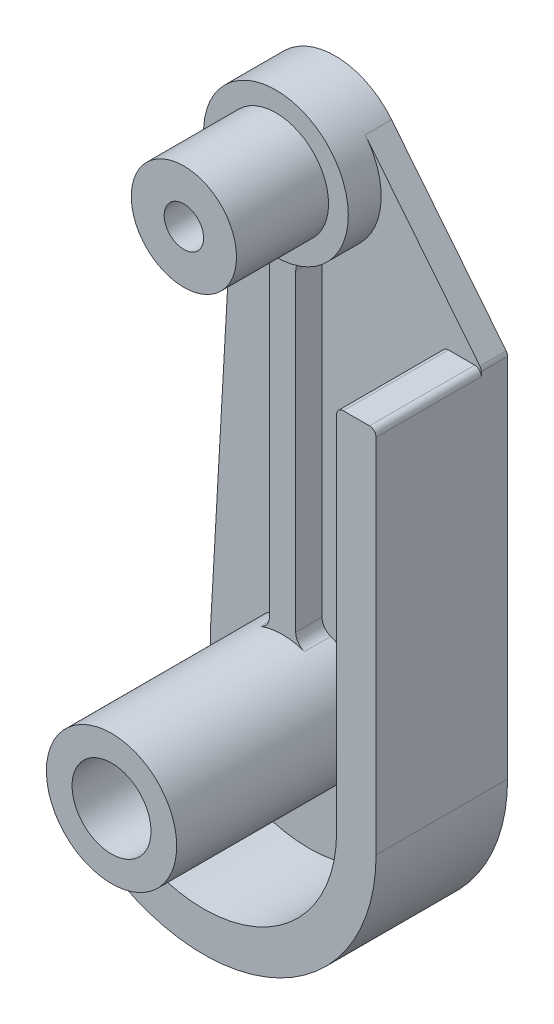
ISO-10303-21;
HEADER;
FILE_DESCRIPTION(('STEP AP214'),'2;1');
FILE_NAME('part.step','',(''),(''),'','','');
FILE_SCHEMA(('AUTOMOTIVE_DESIGN { 1 0 10303 214 1 1 1 1 }'));
ENDSEC;
DATA;
#1=APPLICATION_CONTEXT('core data for automotive mechanical design processes');
#2=APPLICATION_PROTOCOL_DEFINITION('international standard','automotive_design',2000,#1);
#3=PRODUCT_CONTEXT('',#1,'mechanical');
#4=PRODUCT('Part','Part','',(#3));
#5=PRODUCT_RELATED_PRODUCT_CATEGORY('part','',(#4));
#6=PRODUCT_DEFINITION_FORMATION('','',#4);
#7=PRODUCT_DEFINITION_CONTEXT('part definition',#1,'design');
#8=PRODUCT_DEFINITION('design','',#6,#7);
#9=PRODUCT_DEFINITION_SHAPE('','',#8);
#10=(LENGTH_UNIT() NAMED_UNIT(*) SI_UNIT(.MILLI.,.METRE.));
#11=(NAMED_UNIT(*) PLANE_ANGLE_UNIT() SI_UNIT($,.RADIAN.));
#12=(NAMED_UNIT(*) SI_UNIT($,.STERADIAN.) SOLID_ANGLE_UNIT());
#13=UNCERTAINTY_MEASURE_WITH_UNIT(LENGTH_MEASURE(1.E-05),#10,'distance_accuracy_value','');
#14=(GEOMETRIC_REPRESENTATION_CONTEXT(3) GLOBAL_UNCERTAINTY_ASSIGNED_CONTEXT((#13)) GLOBAL_UNIT_ASSIGNED_CONTEXT((#10,
#11,#12)) REPRESENTATION_CONTEXT('',''));
#15=CARTESIAN_POINT('',(0.,0.,0.));
#16=DIRECTION('',(0.,0.,1.));
#17=DIRECTION('',(1.,0.,0.));
#18=AXIS2_PLACEMENT_3D('',#15,#16,#17);
#19=CARTESIAN_POINT('',(0.,0.,2.));
#20=DIRECTION('',(0.,0.,1.));
#21=DIRECTION('',(1.,0.,0.));
#22=AXIS2_PLACEMENT_3D('',#19,#20,#21);
#23=PLANE('',#22);
#24=CARTESIAN_POINT('',(0.,35.56,2.));
#25=DIRECTION('',(0.,0.,1.));
#26=DIRECTION('',(1.,0.,0.));
#27=AXIS2_PLACEMENT_3D('',#24,#25,#26);
#28=CIRCLE('',#27,5.5);
#29=CARTESIAN_POINT('',(1.69230769230769,30.3268274751776,2.));
#30=VERTEX_POINT('',#29);
#31=CARTESIAN_POINT('',(4.29079082696684,39.00080137166,2.));
#32=VERTEX_POINT('',#31);
#33=EDGE_CURVE('E279',#30,#32,#28,.T.);
#34=ORIENTED_EDGE('',*,*,#33,.F.);
#35=CARTESIAN_POINT('',(2.,29.3753415615735,2.));
#36=DIRECTION('',(0.,0.,1.));
#37=DIRECTION('',(1.,0.,0.));
#38=AXIS2_PLACEMENT_3D('',#35,#36,#37);
#39=CIRCLE('',#38,1.);
#40=CARTESIAN_POINT('',(1.,29.3753415615735,2.));
#41=VERTEX_POINT('',#40);
#42=EDGE_CURVE('E493',#30,#41,#39,.T.);
#43=ORIENTED_EDGE('',*,*,#42,.T.);
#44=DIRECTION('',(0.,1.,0.));
#45=VECTOR('',#44,1.);
#46=CARTESIAN_POINT('',(1.,30.151673086804,2.));
#47=LINE('',#46,#45);
#48=CARTESIAN_POINT('',(0.999999999999998,5.60697859814,2.));
#49=VERTEX_POINT('',#48);
#50=EDGE_CURVE('E543',#49,#41,#47,.T.);
#51=ORIENTED_EDGE('',*,*,#50,.F.);
#52=CARTESIAN_POINT('',(2.,5.60697859814,2.));
#53=DIRECTION('',(0.,0.,1.));
#54=DIRECTION('',(1.,0.,0.));
#55=AXIS2_PLACEMENT_3D('',#52,#53,#54);
#56=CIRCLE('',#55,1.);
#57=CARTESIAN_POINT('',(1.6640349403662,4.66510414859523,2.));
#58=VERTEX_POINT('',#57);
#59=EDGE_CURVE('E488',#49,#58,#56,.T.);
#60=ORIENTED_EDGE('',*,*,#59,.T.);
#61=CARTESIAN_POINT('',(0.,0.,2.));
#62=DIRECTION('',(0.,0.,1.));
#63=DIRECTION('',(1.,0.,0.));
#64=AXIS2_PLACEMENT_3D('',#61,#62,#63);
#65=CIRCLE('',#64,4.953);
#66=CARTESIAN_POINT('',(-1.6640349403662,4.66510414859523,2.));
#67=VERTEX_POINT('',#66);
#68=EDGE_CURVE('E345',#58,#67,#65,.F.);
#69=ORIENTED_EDGE('',*,*,#68,.T.);
#70=CARTESIAN_POINT('',(-2.,5.60697859814,2.));
#71=DIRECTION('',(0.,0.,1.));
#72=DIRECTION('',(1.,0.,0.));
#73=AXIS2_PLACEMENT_3D('',#70,#71,#72);
#74=CIRCLE('',#73,1.);
#75=CARTESIAN_POINT('',(-0.999999999999998,5.60697859814,2.));
#76=VERTEX_POINT('',#75);
#77=EDGE_CURVE('E485',#67,#76,#74,.T.);
#78=ORIENTED_EDGE('',*,*,#77,.T.);
#79=DIRECTION('',(0.,-1.,0.));
#80=VECTOR('',#79,1.);
#81=CARTESIAN_POINT('',(-1.,30.151673086804,2.));
#82=LINE('',#81,#80);
#83=CARTESIAN_POINT('',(-1.,29.3753415615735,2.));
#84=VERTEX_POINT('',#83);
#85=EDGE_CURVE('E550',#84,#76,#82,.T.);
#86=ORIENTED_EDGE('',*,*,#85,.F.);
#87=CARTESIAN_POINT('',(-2.,29.3753415615735,2.));
#88=DIRECTION('',(0.,0.,1.));
#89=DIRECTION('',(1.,0.,0.));
#90=AXIS2_PLACEMENT_3D('',#87,#88,#89);
#91=CIRCLE('',#90,1.);
#92=CARTESIAN_POINT('',(-1.69230769230769,30.3268274751776,2.));
#93=VERTEX_POINT('',#92);
#94=EDGE_CURVE('E276',#84,#93,#91,.T.);
#95=ORIENTED_EDGE('',*,*,#94,.T.);
#96=CARTESIAN_POINT('',(-5.49129411278543,35.8693363329584,2.));
#97=VERTEX_POINT('',#96);
#98=EDGE_CURVE('E266',#97,#93,#28,.T.);
#99=ORIENTED_EDGE('',*,*,#98,.F.);
#100=DIRECTION('',(0.0562429696287964,0.998417111415532,0.));
#101=VECTOR('',#100,1.);
#102=CARTESIAN_POINT('',(-7.48812833561649,0.421822272215973,2.));
#103=LINE('',#102,#101);
#104=CARTESIAN_POINT('',(-7.48812833561649,0.421822272215973,2.));
#105=VERTEX_POINT('',#104);
#106=EDGE_CURVE('E247',#105,#97,#103,.T.);
#107=ORIENTED_EDGE('',*,*,#106,.F.);
#108=CARTESIAN_POINT('',(0.,0.,2.));
#109=DIRECTION('',(0.,0.,1.));
#110=DIRECTION('',(1.,0.,0.));
#111=AXIS2_PLACEMENT_3D('',#108,#109,#110);
#112=CIRCLE('',#111,7.5);
#113=CARTESIAN_POINT('',(-4.14861802271251,-6.24811719653409,2.));
#114=VERTEX_POINT('',#113);
#115=EDGE_CURVE('E259',#105,#114,#112,.T.);
#116=ORIENTED_EDGE('',*,*,#115,.T.);
#117=CARTESIAN_POINT('',(-4.42519255756001,-6.66465834296969,2.));
#118=DIRECTION('',(0.,0.,1.));
#119=DIRECTION('',(1.,0.,0.));
#120=AXIS2_PLACEMENT_3D('',#117,#118,#119);
#121=CIRCLE('',#120,0.5);
#122=CARTESIAN_POINT('',(-3.99217985566779,-6.91465834296969,2.));
#123=VERTEX_POINT('',#122);
#124=EDGE_CURVE('E475',#114,#123,#121,.F.);
#125=ORIENTED_EDGE('',*,*,#124,.T.);
#126=DIRECTION('',(0.499999999999995,0.866025403784442,0.));
#127=VECTOR('',#126,1.);
#128=CARTESIAN_POINT('',(0.,0.,2.));
#129=LINE('',#128,#127);
#130=CARTESIAN_POINT('',(-5.30029487718897,-9.18038002238847,2.));
#131=VERTEX_POINT('',#130);
#132=EDGE_CURVE('E356',#131,#123,#129,.T.);
#133=ORIENTED_EDGE('',*,*,#132,.F.);
#134=CARTESIAN_POINT('',(-4.86728217529675,-9.43038002238847,2.));
#135=DIRECTION('',(0.,0.,1.));
#136=DIRECTION('',(1.,0.,0.));
#137=AXIS2_PLACEMENT_3D('',#134,#135,#136);
#138=CIRCLE('',#137,0.5);
#139=CARTESIAN_POINT('',(-4.63796111496404,-8.98606948764066,2.));
#140=VERTEX_POINT('',#139);
#141=EDGE_CURVE('E469',#131,#140,#138,.F.);
#142=ORIENTED_EDGE('',*,*,#141,.T.);
#143=CARTESIAN_POINT('',(0.,0.,2.));
#144=DIRECTION('',(0.,0.,1.));
#145=DIRECTION('',(1.,0.,0.));
#146=AXIS2_PLACEMENT_3D('',#143,#144,#145);
#147=CIRCLE('',#146,10.112375);
#148=CARTESIAN_POINT('',(10.112375,0.,2.));
#149=VERTEX_POINT('',#148);
#150=EDGE_CURVE('E318',#149,#140,#147,.F.);
#151=ORIENTED_EDGE('',*,*,#150,.F.);
#152=DIRECTION('',(0.,-1.,0.));
#153=VECTOR('',#152,1.);
#154=CARTESIAN_POINT('',(10.112375,0.,2.));
#155=LINE('',#154,#153);
#156=CARTESIAN_POINT('',(10.112375,27.5,2.));
#157=VERTEX_POINT('',#156);
#158=EDGE_CURVE('E334',#157,#149,#155,.T.);
#159=ORIENTED_EDGE('',*,*,#158,.F.);
#160=CARTESIAN_POINT('',(10.612375,27.5,2.));
#161=DIRECTION('',(0.,0.,1.));
#162=DIRECTION('',(1.,0.,0.));
#163=AXIS2_PLACEMENT_3D('',#160,#161,#162);
#164=CIRCLE('',#163,0.5);
#165=CARTESIAN_POINT('',(10.612375,28.,2.));
#166=VERTEX_POINT('',#165);
#167=EDGE_CURVE('E419',#157,#166,#164,.F.);
#168=ORIENTED_EDGE('',*,*,#167,.T.);
#169=DIRECTION('',(-1.,0.,0.));
#170=VECTOR('',#169,1.);
#171=CARTESIAN_POINT('',(0.,28.,2.));
#172=LINE('',#171,#170);
#173=CARTESIAN_POINT('',(12.612375,28.,2.));
#174=VERTEX_POINT('',#173);
#175=EDGE_CURVE('E330',#174,#166,#172,.T.);
#176=ORIENTED_EDGE('',*,*,#175,.F.);
#177=CARTESIAN_POINT('',(12.612375,27.5,2.));
#178=DIRECTION('',(0.,0.,1.));
#179=DIRECTION('',(1.,0.,0.));
#180=AXIS2_PLACEMENT_3D('',#177,#178,#179);
#181=CIRCLE('',#180,0.5);
#182=CARTESIAN_POINT('',(13.112375,27.5,2.));
#183=VERTEX_POINT('',#182);
#184=EDGE_CURVE('E422',#174,#183,#181,.F.);
#185=ORIENTED_EDGE('',*,*,#184,.T.);
#186=DIRECTION('',(0.,-1.,0.));
#187=VECTOR('',#186,1.);
#188=CARTESIAN_POINT('',(13.112375,0.,2.));
#189=LINE('',#188,#187);
#190=CARTESIAN_POINT('',(13.112375,27.8242837870572,2.));
#191=VERTEX_POINT('',#190);
#192=EDGE_CURVE('E416',#191,#183,#189,.T.);
#193=ORIENTED_EDGE('',*,*,#192,.F.);
#194=CARTESIAN_POINT('',(12.612375,27.8242837870572,2.));
#195=DIRECTION('',(0.,0.,1.));
#196=DIRECTION('',(1.,0.,0.));
#197=AXIS2_PLACEMENT_3D('',#194,#195,#196);
#198=CIRCLE('',#197,0.5);
#199=CARTESIAN_POINT('',(13.0024468933606,28.1370839117535,2.));
#200=VERTEX_POINT('',#199);
#201=EDGE_CURVE('E436',#191,#200,#198,.T.);
#202=ORIENTED_EDGE('',*,*,#201,.T.);
#203=DIRECTION('',(0.625600249392723,-0.780143786721245,0.));
#204=VECTOR('',#203,1.);
#205=CARTESIAN_POINT('',(21.6461385533112,17.3581202694108,2.));
#206=LINE('',#205,#204);
#207=EDGE_CURVE('E260',#32,#200,#206,.T.);
#208=ORIENTED_EDGE('',*,*,#207,.F.);
#209=EDGE_LOOP('',(#34,#43,#51,#60,#69,#78,#86,#95,#99,#107,#116,#125,#133,#142,#151,#159,#168,
#176,#185,#193,#202,#208));
#210=FACE_BOUND('',#209,.T.);
#211=ADVANCED_FACE('F83',(#210),#23,.T.);
#212=CARTESIAN_POINT('',(0.,35.56,2.));
#213=DIRECTION('',(0.,0.,-1.));
#214=DIRECTION('',(-1.,0.,0.));
#215=AXIS2_PLACEMENT_3D('',#212,#213,#214);
#216=CYLINDRICAL_SURFACE('',#215,5.5);
#217=CARTESIAN_POINT('',(0.,35.56,4.5));
#218=DIRECTION('',(0.,0.,1.));
#219=DIRECTION('',(1.,0.,0.));
#220=AXIS2_PLACEMENT_3D('',#217,#218,#219);
#221=CIRCLE('',#220,5.5);
#222=CARTESIAN_POINT('',(5.5,35.56,4.5));
#223=VERTEX_POINT('',#222);
#224=EDGE_CURVE('E278',#223,#223,#221,.T.);
#225=ORIENTED_EDGE('',*,*,#224,.F.);
#226=EDGE_LOOP('',(#225));
#227=FACE_BOUND('',#226,.T.);
#228=CARTESIAN_POINT('',(0.,35.56,4.));
#229=DIRECTION('',(0.,0.,1.));
#230=DIRECTION('',(1.,0.,0.));
#231=AXIS2_PLACEMENT_3D('',#228,#229,#230);
#232=CIRCLE('',#231,5.5);
#233=CARTESIAN_POINT('',(-1.69230769230769,30.3268274751776,4.));
#234=VERTEX_POINT('',#233);
#235=CARTESIAN_POINT('',(1.69230769230769,30.3268274751776,4.));
#236=VERTEX_POINT('',#235);
#237=EDGE_CURVE('E538',#234,#236,#232,.T.);
#238=ORIENTED_EDGE('',*,*,#237,.T.);
#239=DIRECTION('',(0.,0.,-1.));
#240=VECTOR('',#239,1.);
#241=CARTESIAN_POINT('',(1.69230769230769,30.3268274751776,2.));
#242=LINE('',#241,#240);
#243=EDGE_CURVE('E481',#236,#30,#242,.T.);
#244=ORIENTED_EDGE('',*,*,#243,.T.);
#245=ORIENTED_EDGE('',*,*,#33,.T.);
#246=DIRECTION('',(0.,0.,-1.));
#247=VECTOR('',#246,1.);
#248=CARTESIAN_POINT('',(4.29079082696684,39.00080137166,2.));
#249=LINE('',#248,#247);
#250=CARTESIAN_POINT('',(4.29079082696684,39.00080137166,0.));
#251=VERTEX_POINT('',#250);
#252=EDGE_CURVE('E272',#32,#251,#249,.T.);
#253=ORIENTED_EDGE('',*,*,#252,.T.);
#254=CARTESIAN_POINT('',(0.,35.56,0.));
#255=DIRECTION('',(0.,0.,1.));
#256=DIRECTION('',(1.,0.,0.));
#257=AXIS2_PLACEMENT_3D('',#254,#255,#256);
#258=CIRCLE('',#257,5.5);
#259=CARTESIAN_POINT('',(-5.49129411278543,35.8693363329584,0.));
#260=VERTEX_POINT('',#259);
#261=EDGE_CURVE('E269',#251,#260,#258,.T.);
#262=ORIENTED_EDGE('',*,*,#261,.T.);
#263=DIRECTION('',(0.,0.,-1.));
#264=VECTOR('',#263,1.);
#265=CARTESIAN_POINT('',(-5.49129411278543,35.8693363329584,2.));
#266=LINE('',#265,#264);
#267=EDGE_CURVE('E251',#97,#260,#266,.T.);
#268=ORIENTED_EDGE('',*,*,#267,.F.);
#269=ORIENTED_EDGE('',*,*,#98,.T.);
#270=DIRECTION('',(0.,0.,-1.));
#271=VECTOR('',#270,1.);
#272=CARTESIAN_POINT('',(-1.69230769230769,30.3268274751776,2.));
#273=LINE('',#272,#271);
#274=EDGE_CURVE('E478',#93,#234,#273,.F.);
#275=ORIENTED_EDGE('',*,*,#274,.T.);
#276=EDGE_LOOP('',(#238,#244,#245,#253,#262,#268,#269,#275));
#277=FACE_BOUND('',#276,.T.);
#278=ADVANCED_FACE('F264',(#227,#277),#216,.T.);
#279=CARTESIAN_POINT('',(0.,0.,17.));
#280=DIRECTION('',(0.,0.,-1.));
#281=DIRECTION('',(-1.,0.,0.));
#282=AXIS2_PLACEMENT_3D('',#279,#280,#281);
#283=CYLINDRICAL_SURFACE('',#282,4.953);
#284=CARTESIAN_POINT('',(0.,0.,17.));
#285=DIRECTION('',(0.,0.,1.));
#286=DIRECTION('',(1.,0.,0.));
#287=AXIS2_PLACEMENT_3D('',#284,#285,#286);
#288=CIRCLE('',#287,4.953);
#289=CARTESIAN_POINT('',(4.953,0.,17.));
#290=VERTEX_POINT('',#289);
#291=EDGE_CURVE('E341',#290,#290,#288,.T.);
#292=ORIENTED_EDGE('',*,*,#291,.F.);
#293=EDGE_LOOP('',(#292));
#294=FACE_BOUND('',#293,.T.);
#295=ORIENTED_EDGE('',*,*,#68,.F.);
#296=DIRECTION('',(0.,0.,-1.));
#297=VECTOR('',#296,1.);
#298=CARTESIAN_POINT('',(1.6640349403662,4.66510414859523,17.));
#299=LINE('',#298,#297);
#300=CARTESIAN_POINT('',(1.6640349403662,4.66510414859523,4.));
#301=VERTEX_POINT('',#300);
#302=EDGE_CURVE('E513',#58,#301,#299,.F.);
#303=ORIENTED_EDGE('',*,*,#302,.T.);
#304=CARTESIAN_POINT('',(0.,0.,4.));
#305=DIRECTION('',(0.,0.,1.));
#306=DIRECTION('',(1.,0.,0.));
#307=AXIS2_PLACEMENT_3D('',#304,#305,#306);
#308=CIRCLE('',#307,4.953);
#309=CARTESIAN_POINT('',(-1.6640349403662,4.66510414859523,4.));
#310=VERTEX_POINT('',#309);
#311=EDGE_CURVE('E98',#301,#310,#308,.T.);
#312=ORIENTED_EDGE('',*,*,#311,.T.);
#313=DIRECTION('',(0.,0.,-1.));
#314=VECTOR('',#313,1.);
#315=CARTESIAN_POINT('',(-1.6640349403662,4.66510414859523,17.));
#316=LINE('',#315,#314);
#317=EDGE_CURVE('E510',#310,#67,#316,.T.);
#318=ORIENTED_EDGE('',*,*,#317,.T.);
#319=EDGE_LOOP('',(#295,#303,#312,#318));
#320=FACE_BOUND('',#319,.T.);
#321=ADVANCED_FACE('F544',(#294,#320),#283,.T.);
#322=CARTESIAN_POINT('',(0.,0.,2.));
#323=DIRECTION('',(0.,0.,-1.));
#324=DIRECTION('',(-1.,0.,0.));
#325=AXIS2_PLACEMENT_3D('',#322,#323,#324);
#326=CYLINDRICAL_SURFACE('',#325,13.112375);
#327=CARTESIAN_POINT('',(0.,0.,10.));
#328=DIRECTION('',(0.,0.,1.));
#329=DIRECTION('',(1.,0.,0.));
#330=AXIS2_PLACEMENT_3D('',#327,#328,#329);
#331=CIRCLE('',#330,13.112375);
#332=CARTESIAN_POINT('',(-6.10085468581522,-11.6066338894268,10.));
#333=VERTEX_POINT('',#332);
#334=CARTESIAN_POINT('',(13.112375,0.,10.));
#335=VERTEX_POINT('',#334);
#336=EDGE_CURVE('E322',#333,#335,#331,.T.);
#337=ORIENTED_EDGE('',*,*,#336,.F.);
#338=DIRECTION('',(0.,0.,-1.));
#339=VECTOR('',#338,1.);
#340=CARTESIAN_POINT('',(-6.10085468581522,-11.6066338894268,2.));
#341=LINE('',#340,#339);
#342=CARTESIAN_POINT('',(-6.10085468581522,-11.6066338894268,0.));
#343=VERTEX_POINT('',#342);
#344=EDGE_CURVE('E439',#333,#343,#341,.T.);
#345=ORIENTED_EDGE('',*,*,#344,.T.);
#346=CARTESIAN_POINT('',(0.,0.,0.));
#347=DIRECTION('',(0.,0.,1.));
#348=DIRECTION('',(1.,0.,0.));
#349=AXIS2_PLACEMENT_3D('',#346,#347,#348);
#350=CIRCLE('',#349,13.112375);
#351=CARTESIAN_POINT('',(13.112375,0.,0.));
#352=VERTEX_POINT('',#351);
#353=EDGE_CURVE('E349',#343,#352,#350,.T.);
#354=ORIENTED_EDGE('',*,*,#353,.T.);
#355=DIRECTION('',(0.,0.,-1.));
#356=VECTOR('',#355,1.);
#357=CARTESIAN_POINT('',(13.112375,0.,2.));
#358=LINE('',#357,#356);
#359=EDGE_CURVE('E390',#335,#352,#358,.T.);
#360=ORIENTED_EDGE('',*,*,#359,.F.);
#361=EDGE_LOOP('',(#337,#345,#354,#360));
#362=FACE_BOUND('',#361,.T.);
#363=ADVANCED_FACE('F621',(#362),#326,.T.);
#364=CARTESIAN_POINT('',(13.112375,0.,2.));
#365=DIRECTION('',(-1.,0.,0.));
#366=DIRECTION('',(0.,0.,1.));
#367=AXIS2_PLACEMENT_3D('',#364,#365,#366);
#368=PLANE('',#367);
#369=DIRECTION('',(0.,1.,0.));
#370=VECTOR('',#369,1.);
#371=CARTESIAN_POINT('',(13.112375,0.,0.));
#372=LINE('',#371,#370);
#373=CARTESIAN_POINT('',(13.112375,27.8242837870572,0.));
#374=VERTEX_POINT('',#373);
#375=EDGE_CURVE('E362',#352,#374,#372,.T.);
#376=ORIENTED_EDGE('',*,*,#375,.T.);
#377=DIRECTION('',(0.,0.,-1.));
#378=VECTOR('',#377,1.);
#379=CARTESIAN_POINT('',(13.112375,27.8242837870572,2.));
#380=LINE('',#379,#378);
#381=EDGE_CURVE('E433',#374,#191,#380,.F.);
#382=ORIENTED_EDGE('',*,*,#381,.T.);
#383=ORIENTED_EDGE('',*,*,#192,.T.);
#384=DIRECTION('',(0.,0.,-1.));
#385=VECTOR('',#384,1.);
#386=CARTESIAN_POINT('',(13.112375,27.5,10.));
#387=LINE('',#386,#385);
#388=CARTESIAN_POINT('',(13.112375,27.5,10.));
#389=VERTEX_POINT('',#388);
#390=EDGE_CURVE('E413',#183,#389,#387,.F.);
#391=ORIENTED_EDGE('',*,*,#390,.T.);
#392=DIRECTION('',(0.,1.,0.));
#393=VECTOR('',#392,1.);
#394=CARTESIAN_POINT('',(13.112375,0.,10.));
#395=LINE('',#394,#393);
#396=EDGE_CURVE('E310',#335,#389,#395,.T.);
#397=ORIENTED_EDGE('',*,*,#396,.F.);
#398=ORIENTED_EDGE('',*,*,#359,.T.);
#399=EDGE_LOOP('',(#376,#382,#383,#391,#397,#398));
#400=FACE_BOUND('',#399,.T.);
#401=ADVANCED_FACE('F617',(#400),#368,.F.);
#402=CARTESIAN_POINT('',(21.6461385533112,17.3581202694108,2.));
#403=DIRECTION('',(0.780143786721245,0.625600249392723,0.));
#404=DIRECTION('',(-0.625600249392723,0.780143786721245,0.));
#405=AXIS2_PLACEMENT_3D('',#402,#403,#404);
#406=PLANE('',#405);
#407=ORIENTED_EDGE('',*,*,#207,.T.);
#408=DIRECTION('',(0.,0.,-1.));
#409=VECTOR('',#408,1.);
#410=CARTESIAN_POINT('',(13.0024468933606,28.1370839117535,0.));
#411=LINE('',#410,#409);
#412=CARTESIAN_POINT('',(13.0024468933606,28.1370839117535,0.));
#413=VERTEX_POINT('',#412);
#414=EDGE_CURVE('E426',#200,#413,#411,.T.);
#415=ORIENTED_EDGE('',*,*,#414,.T.);
#416=DIRECTION('',(0.625600249392723,-0.780143786721245,0.));
#417=VECTOR('',#416,1.);
#418=CARTESIAN_POINT('',(21.6461385533112,17.3581202694108,0.));
#419=LINE('',#418,#417);
#420=EDGE_CURVE('E366',#251,#413,#419,.T.);
#421=ORIENTED_EDGE('',*,*,#420,.F.);
#422=ORIENTED_EDGE('',*,*,#252,.F.);
#423=EDGE_LOOP('',(#407,#415,#421,#422));
#424=FACE_BOUND('',#423,.T.);
#425=ADVANCED_FACE('F613',(#424),#406,.T.);
#426=CARTESIAN_POINT('',(-7.48812833561649,0.421822272215973,2.));
#427=DIRECTION('',(-0.998417111415532,0.0562429696287964,0.));
#428=DIRECTION('',(-0.0562429696287964,-0.998417111415532,0.));
#429=AXIS2_PLACEMENT_3D('',#426,#427,#428);
#430=PLANE('',#429);
#431=DIRECTION('',(0.0562429696287964,0.998417111415532,0.));
#432=VECTOR('',#431,1.);
#433=CARTESIAN_POINT('',(-7.48812833561649,0.421822272215973,0.));
#434=LINE('',#433,#432);
#435=CARTESIAN_POINT('',(-7.48812833561649,0.421822272215973,0.));
#436=VERTEX_POINT('',#435);
#437=EDGE_CURVE('E372',#436,#260,#434,.T.);
#438=ORIENTED_EDGE('',*,*,#437,.F.);
#439=DIRECTION('',(0.,0.,-1.));
#440=VECTOR('',#439,1.);
#441=CARTESIAN_POINT('',(-7.48812833561649,0.421822272215973,2.));
#442=LINE('',#441,#440);
#443=EDGE_CURVE('E253',#105,#436,#442,.T.);
#444=ORIENTED_EDGE('',*,*,#443,.F.);
#445=ORIENTED_EDGE('',*,*,#106,.T.);
#446=ORIENTED_EDGE('',*,*,#267,.T.);
#447=EDGE_LOOP('',(#438,#444,#445,#446));
#448=FACE_BOUND('',#447,.T.);
#449=ADVANCED_FACE('F250',(#448),#430,.T.);
#450=CARTESIAN_POINT('',(0.,0.,2.));
#451=DIRECTION('',(0.,0.,-1.));
#452=DIRECTION('',(-1.,0.,0.));
#453=AXIS2_PLACEMENT_3D('',#450,#451,#452);
#454=CYLINDRICAL_SURFACE('',#453,7.5);
#455=CARTESIAN_POINT('',(0.,0.,0.));
#456=DIRECTION('',(0.,0.,1.));
#457=DIRECTION('',(1.,0.,0.));
#458=AXIS2_PLACEMENT_3D('',#455,#456,#457);
#459=CIRCLE('',#458,7.5);
#460=CARTESIAN_POINT('',(-4.14861802271251,-6.24811719653409,0.));
#461=VERTEX_POINT('',#460);
#462=EDGE_CURVE('E375',#436,#461,#459,.T.);
#463=ORIENTED_EDGE('',*,*,#462,.T.);
#464=DIRECTION('',(0.,0.,-1.));
#465=VECTOR('',#464,1.);
#466=CARTESIAN_POINT('',(-4.14861802271251,-6.24811719653409,2.));
#467=LINE('',#466,#465);
#468=EDGE_CURVE('E466',#461,#114,#467,.F.);
#469=ORIENTED_EDGE('',*,*,#468,.T.);
#470=ORIENTED_EDGE('',*,*,#115,.F.);
#471=ORIENTED_EDGE('',*,*,#443,.T.);
#472=EDGE_LOOP('',(#463,#469,#470,#471));
#473=FACE_BOUND('',#472,.T.);
#474=ADVANCED_FACE('F607',(#473),#454,.T.);
#475=CARTESIAN_POINT('',(0.,0.,2.));
#476=DIRECTION('',(-0.866025403784442,0.499999999999995,0.));
#477=DIRECTION('',(-0.499999999999995,-0.866025403784442,0.));
#478=AXIS2_PLACEMENT_3D('',#475,#476,#477);
#479=PLANE('',#478);
#480=DIRECTION('',(0.499999999999995,0.866025403784442,0.));
#481=VECTOR('',#480,1.);
#482=CARTESIAN_POINT('',(0.,0.,0.));
#483=LINE('',#482,#481);
#484=CARTESIAN_POINT('',(-6.30123010095294,-10.914050685033,0.));
#485=VERTEX_POINT('',#484);
#486=CARTESIAN_POINT('',(-3.99217985566779,-6.91465834296969,0.));
#487=VERTEX_POINT('',#486);
#488=EDGE_CURVE('E379',#485,#487,#483,.T.);
#489=ORIENTED_EDGE('',*,*,#488,.F.);
#490=DIRECTION('',(0.,0.,1.));
#491=VECTOR('',#490,1.);
#492=CARTESIAN_POINT('',(-6.30123010095294,-10.914050685033,10.));
#493=LINE('',#492,#491);
#494=CARTESIAN_POINT('',(-6.30123010095294,-10.914050685033,10.));
#495=VERTEX_POINT('',#494);
#496=EDGE_CURVE('E454',#485,#495,#493,.T.);
#497=ORIENTED_EDGE('',*,*,#496,.T.);
#498=DIRECTION('',(-0.499999999999995,-0.866025403784442,0.));
#499=VECTOR('',#498,1.);
#500=CARTESIAN_POINT('',(-5.05618749999994,-8.75757364259469,10.));
#501=LINE('',#500,#499);
#502=CARTESIAN_POINT('',(-5.30029487718897,-9.18038002238847,10.));
#503=VERTEX_POINT('',#502);
#504=EDGE_CURVE('E297',#503,#495,#501,.T.);
#505=ORIENTED_EDGE('',*,*,#504,.F.);
#506=DIRECTION('',(0.,0.,-1.));
#507=VECTOR('',#506,1.);
#508=CARTESIAN_POINT('',(-5.30029487718897,-9.18038002238847,2.));
#509=LINE('',#508,#507);
#510=EDGE_CURVE('E450',#503,#131,#509,.T.);
#511=ORIENTED_EDGE('',*,*,#510,.T.);
#512=ORIENTED_EDGE('',*,*,#132,.T.);
#513=DIRECTION('',(0.,0.,-1.));
#514=VECTOR('',#513,1.);
#515=CARTESIAN_POINT('',(-3.99217985566778,-6.91465834296969,2.));
#516=LINE('',#515,#514);
#517=EDGE_CURVE('E446',#123,#487,#516,.T.);
#518=ORIENTED_EDGE('',*,*,#517,.T.);
#519=EDGE_LOOP('',(#489,#497,#505,#511,#512,#518));
#520=FACE_BOUND('',#519,.T.);
#521=ADVANCED_FACE('F603',(#520),#479,.T.);
#522=CARTESIAN_POINT('',(0.,0.,2.));
#523=DIRECTION('',(0.,0.,-1.));
#524=DIRECTION('',(-1.,0.,0.));
#525=AXIS2_PLACEMENT_3D('',#522,#523,#524);
#526=CYLINDRICAL_SURFACE('',#525,3.);
#527=CARTESIAN_POINT('',(0.,0.,0.));
#528=DIRECTION('',(0.,0.,1.));
#529=DIRECTION('',(1.,0.,0.));
#530=AXIS2_PLACEMENT_3D('',#527,#528,#529);
#531=CIRCLE('',#530,3.);
#532=CARTESIAN_POINT('',(3.,0.,0.));
#533=VERTEX_POINT('',#532);
#534=EDGE_CURVE('E352',#533,#533,#531,.T.);
#535=ORIENTED_EDGE('',*,*,#534,.F.);
#536=EDGE_LOOP('',(#535));
#537=FACE_BOUND('',#536,.T.);
#538=CARTESIAN_POINT('',(0.,0.,17.));
#539=DIRECTION('',(0.,0.,1.));
#540=DIRECTION('',(1.,0.,0.));
#541=AXIS2_PLACEMENT_3D('',#538,#539,#540);
#542=CIRCLE('',#541,3.);
#543=CARTESIAN_POINT('',(3.,0.,17.));
#544=VERTEX_POINT('',#543);
#545=EDGE_CURVE('E337',#544,#544,#542,.T.);
#546=ORIENTED_EDGE('',*,*,#545,.T.);
#547=EDGE_LOOP('',(#546));
#548=FACE_BOUND('',#547,.T.);
#549=ADVANCED_FACE('F599',(#537,#548),#526,.F.);
#550=CARTESIAN_POINT('',(0.,0.,0.));
#551=DIRECTION('',(0.,0.,1.));
#552=DIRECTION('',(1.,0.,0.));
#553=AXIS2_PLACEMENT_3D('',#550,#551,#552);
#554=PLANE('',#553);
#555=ORIENTED_EDGE('',*,*,#353,.F.);
#556=CARTESIAN_POINT('',(-5.86821739906072,-11.164050685033,0.));
#557=DIRECTION('',(0.,0.,1.));
#558=DIRECTION('',(1.,0.,0.));
#559=AXIS2_PLACEMENT_3D('',#556,#557,#558);
#560=CIRCLE('',#559,0.5);
#561=EDGE_CURVE('E443',#343,#485,#560,.F.);
#562=ORIENTED_EDGE('',*,*,#561,.T.);
#563=ORIENTED_EDGE('',*,*,#488,.T.);
#564=CARTESIAN_POINT('',(-4.42519255756001,-6.66465834296969,0.));
#565=DIRECTION('',(0.,0.,1.));
#566=DIRECTION('',(1.,0.,0.));
#567=AXIS2_PLACEMENT_3D('',#564,#565,#566);
#568=CIRCLE('',#567,0.5);
#569=EDGE_CURVE('E472',#487,#461,#568,.T.);
#570=ORIENTED_EDGE('',*,*,#569,.T.);
#571=ORIENTED_EDGE('',*,*,#462,.F.);
#572=ORIENTED_EDGE('',*,*,#437,.T.);
#573=ORIENTED_EDGE('',*,*,#261,.F.);
#574=ORIENTED_EDGE('',*,*,#420,.T.);
#575=CARTESIAN_POINT('',(12.612375,27.8242837870572,0.));
#576=DIRECTION('',(0.,0.,1.));
#577=DIRECTION('',(1.,0.,0.));
#578=AXIS2_PLACEMENT_3D('',#575,#576,#577);
#579=CIRCLE('',#578,0.5);
#580=EDGE_CURVE('E430',#413,#374,#579,.F.);
#581=ORIENTED_EDGE('',*,*,#580,.T.);
#582=ORIENTED_EDGE('',*,*,#375,.F.);
#583=EDGE_LOOP('',(#555,#562,#563,#570,#571,#572,#573,#574,#581,#582));
#584=FACE_BOUND('',#583,.T.);
#585=ORIENTED_EDGE('',*,*,#534,.T.);
#586=EDGE_LOOP('',(#585));
#587=FACE_BOUND('',#586,.T.);
#588=CARTESIAN_POINT('',(0.,35.56,0.));
#589=DIRECTION('',(0.,0.,1.));
#590=DIRECTION('',(1.,0.,0.));
#591=AXIS2_PLACEMENT_3D('',#588,#589,#590);
#592=CIRCLE('',#591,1.5);
#593=CARTESIAN_POINT('',(1.5,35.56,0.));
#594=VERTEX_POINT('',#593);
#595=EDGE_CURVE('E284',#594,#594,#592,.T.);
#596=ORIENTED_EDGE('',*,*,#595,.T.);
#597=EDGE_LOOP('',(#596));
#598=FACE_BOUND('',#597,.T.);
#599=ADVANCED_FACE('F595',(#584,#587,#598),#554,.F.);
#600=CARTESIAN_POINT('',(0.,0.,17.));
#601=DIRECTION('',(0.,0.,1.));
#602=DIRECTION('',(1.,0.,0.));
#603=AXIS2_PLACEMENT_3D('',#600,#601,#602);
#604=PLANE('',#603);
#605=ORIENTED_EDGE('',*,*,#545,.F.);
#606=EDGE_LOOP('',(#605));
#607=FACE_BOUND('',#606,.T.);
#608=ORIENTED_EDGE('',*,*,#291,.T.);
#609=EDGE_LOOP('',(#608));
#610=FACE_BOUND('',#609,.T.);
#611=ADVANCED_FACE('F598',(#607,#610),#604,.T.);
#612=CARTESIAN_POINT('',(10.112375,0.,10.));
#613=DIRECTION('',(-1.,0.,0.));
#614=DIRECTION('',(0.,0.,1.));
#615=AXIS2_PLACEMENT_3D('',#612,#613,#614);
#616=PLANE('',#615);
#617=DIRECTION('',(0.,1.,0.));
#618=VECTOR('',#617,1.);
#619=CARTESIAN_POINT('',(10.112375,0.,10.));
#620=LINE('',#619,#618);
#621=CARTESIAN_POINT('',(10.112375,0.,10.));
#622=VERTEX_POINT('',#621);
#623=CARTESIAN_POINT('',(10.112375,27.5,10.));
#624=VERTEX_POINT('',#623);
#625=EDGE_CURVE('E305',#622,#624,#620,.T.);
#626=ORIENTED_EDGE('',*,*,#625,.T.);
#627=DIRECTION('',(0.,0.,-1.));
#628=VECTOR('',#627,1.);
#629=CARTESIAN_POINT('',(10.112375,27.5,10.));
#630=LINE('',#629,#628);
#631=EDGE_CURVE('E396',#624,#157,#630,.T.);
#632=ORIENTED_EDGE('',*,*,#631,.T.);
#633=ORIENTED_EDGE('',*,*,#158,.T.);
#634=DIRECTION('',(0.,0.,-1.));
#635=VECTOR('',#634,1.);
#636=CARTESIAN_POINT('',(10.112375,0.,10.));
#637=LINE('',#636,#635);
#638=EDGE_CURVE('E314',#622,#149,#637,.T.);
#639=ORIENTED_EDGE('',*,*,#638,.F.);
#640=EDGE_LOOP('',(#626,#632,#633,#639));
#641=FACE_BOUND('',#640,.T.);
#642=ADVANCED_FACE('F816',(#641),#616,.T.);
#643=CARTESIAN_POINT('',(0.,28.,10.));
#644=DIRECTION('',(0.,1.,0.));
#645=DIRECTION('',(0.,0.,1.));
#646=AXIS2_PLACEMENT_3D('',#643,#644,#645);
#647=PLANE('',#646);
#648=ORIENTED_EDGE('',*,*,#175,.T.);
#649=DIRECTION('',(0.,0.,-1.));
#650=VECTOR('',#649,1.);
#651=CARTESIAN_POINT('',(10.612375,28.,10.));
#652=LINE('',#651,#650);
#653=CARTESIAN_POINT('',(10.612375,28.,10.));
#654=VERTEX_POINT('',#653);
#655=EDGE_CURVE('E404',#166,#654,#652,.F.);
#656=ORIENTED_EDGE('',*,*,#655,.T.);
#657=DIRECTION('',(1.,0.,0.));
#658=VECTOR('',#657,1.);
#659=CARTESIAN_POINT('',(0.,28.,10.));
#660=LINE('',#659,#658);
#661=CARTESIAN_POINT('',(12.612375,28.,10.));
#662=VERTEX_POINT('',#661);
#663=EDGE_CURVE('E301',#654,#662,#660,.T.);
#664=ORIENTED_EDGE('',*,*,#663,.T.);
#665=DIRECTION('',(0.,0.,-1.));
#666=VECTOR('',#665,1.);
#667=CARTESIAN_POINT('',(12.612375,28.,2.));
#668=LINE('',#667,#666);
#669=EDGE_CURVE('E400',#662,#174,#668,.T.);
#670=ORIENTED_EDGE('',*,*,#669,.T.);
#671=EDGE_LOOP('',(#648,#656,#664,#670));
#672=FACE_BOUND('',#671,.T.);
#673=ADVANCED_FACE('F806',(#672),#647,.T.);
#674=CARTESIAN_POINT('',(0.,0.,10.));
#675=DIRECTION('',(0.,0.,1.));
#676=DIRECTION('',(1.,0.,0.));
#677=AXIS2_PLACEMENT_3D('',#674,#675,#676);
#678=PLANE('',#677);
#679=ORIENTED_EDGE('',*,*,#504,.T.);
#680=CARTESIAN_POINT('',(-5.86821739906072,-11.164050685033,10.));
#681=DIRECTION('',(0.,0.,1.));
#682=DIRECTION('',(1.,0.,0.));
#683=AXIS2_PLACEMENT_3D('',#680,#681,#682);
#684=CIRCLE('',#683,0.5);
#685=EDGE_CURVE('E460',#495,#333,#684,.T.);
#686=ORIENTED_EDGE('',*,*,#685,.T.);
#687=ORIENTED_EDGE('',*,*,#336,.T.);
#688=ORIENTED_EDGE('',*,*,#396,.T.);
#689=CARTESIAN_POINT('',(12.612375,27.5,10.));
#690=DIRECTION('',(0.,0.,1.));
#691=DIRECTION('',(1.,0.,0.));
#692=AXIS2_PLACEMENT_3D('',#689,#690,#691);
#693=CIRCLE('',#692,0.5);
#694=EDGE_CURVE('E407',#389,#662,#693,.T.);
#695=ORIENTED_EDGE('',*,*,#694,.T.);
#696=ORIENTED_EDGE('',*,*,#663,.F.);
#697=CARTESIAN_POINT('',(10.612375,27.5,10.));
#698=DIRECTION('',(0.,0.,1.));
#699=DIRECTION('',(1.,0.,0.));
#700=AXIS2_PLACEMENT_3D('',#697,#698,#699);
#701=CIRCLE('',#700,0.5);
#702=EDGE_CURVE('E410',#654,#624,#701,.T.);
#703=ORIENTED_EDGE('',*,*,#702,.T.);
#704=ORIENTED_EDGE('',*,*,#625,.F.);
#705=CARTESIAN_POINT('',(0.,0.,10.));
#706=DIRECTION('',(0.,0.,1.));
#707=DIRECTION('',(1.,0.,0.));
#708=AXIS2_PLACEMENT_3D('',#705,#706,#707);
#709=CIRCLE('',#708,10.112375);
#710=CARTESIAN_POINT('',(-4.63796111496404,-8.98606948764066,10.));
#711=VERTEX_POINT('',#710);
#712=EDGE_CURVE('E306',#711,#622,#709,.T.);
#713=ORIENTED_EDGE('',*,*,#712,.F.);
#714=CARTESIAN_POINT('',(-4.86728217529675,-9.43038002238847,10.));
#715=DIRECTION('',(0.,0.,1.));
#716=DIRECTION('',(1.,0.,0.));
#717=AXIS2_PLACEMENT_3D('',#714,#715,#716);
#718=CIRCLE('',#717,0.5);
#719=EDGE_CURVE('E457',#711,#503,#718,.T.);
#720=ORIENTED_EDGE('',*,*,#719,.T.);
#721=EDGE_LOOP('',(#679,#686,#687,#688,#695,#696,#703,#704,#713,#720));
#722=FACE_BOUND('',#721,.T.);
#723=ADVANCED_FACE('F796',(#722),#678,.T.);
#724=CARTESIAN_POINT('',(0.,0.,10.));
#725=DIRECTION('',(0.,0.,-1.));
#726=DIRECTION('',(-1.,0.,0.));
#727=AXIS2_PLACEMENT_3D('',#724,#725,#726);
#728=CYLINDRICAL_SURFACE('',#727,10.112375);
#729=ORIENTED_EDGE('',*,*,#150,.T.);
#730=DIRECTION('',(0.,0.,-1.));
#731=VECTOR('',#730,1.);
#732=CARTESIAN_POINT('',(-4.63796111496404,-8.98606948764067,10.));
#733=LINE('',#732,#731);
#734=EDGE_CURVE('E463',#140,#711,#733,.F.);
#735=ORIENTED_EDGE('',*,*,#734,.T.);
#736=ORIENTED_EDGE('',*,*,#712,.T.);
#737=ORIENTED_EDGE('',*,*,#638,.T.);
#738=EDGE_LOOP('',(#729,#735,#736,#737));
#739=FACE_BOUND('',#738,.T.);
#740=ADVANCED_FACE('F787',(#739),#728,.F.);
#741=CARTESIAN_POINT('',(0.,35.56,11.5));
#742=DIRECTION('',(0.,0.,-1.));
#743=DIRECTION('',(-1.,0.,0.));
#744=AXIS2_PLACEMENT_3D('',#741,#742,#743);
#745=CYLINDRICAL_SURFACE('',#744,1.5);
#746=CARTESIAN_POINT('',(0.,35.56,11.5));
#747=DIRECTION('',(0.,0.,1.));
#748=DIRECTION('',(1.,0.,0.));
#749=AXIS2_PLACEMENT_3D('',#746,#747,#748);
#750=CIRCLE('',#749,1.5);
#751=CARTESIAN_POINT('',(1.5,35.56,11.5));
#752=VERTEX_POINT('',#751);
#753=EDGE_CURVE('E289',#752,#752,#750,.T.);
#754=ORIENTED_EDGE('',*,*,#753,.T.);
#755=EDGE_LOOP('',(#754));
#756=FACE_BOUND('',#755,.T.);
#757=ORIENTED_EDGE('',*,*,#595,.F.);
#758=EDGE_LOOP('',(#757));
#759=FACE_BOUND('',#758,.T.);
#760=ADVANCED_FACE('F779',(#756,#759),#745,.F.);
#761=CARTESIAN_POINT('',(0.,35.56,11.5));
#762=DIRECTION('',(0.,0.,-1.));
#763=DIRECTION('',(-1.,0.,0.));
#764=AXIS2_PLACEMENT_3D('',#761,#762,#763);
#765=CYLINDRICAL_SURFACE('',#764,4.);
#766=CARTESIAN_POINT('',(0.,35.56,4.5));
#767=DIRECTION('',(0.,0.,1.));
#768=DIRECTION('',(1.,0.,0.));
#769=AXIS2_PLACEMENT_3D('',#766,#767,#768);
#770=CIRCLE('',#769,4.);
#771=CARTESIAN_POINT('',(4.,35.56,4.5));
#772=VERTEX_POINT('',#771);
#773=EDGE_CURVE('E286',#772,#772,#770,.T.);
#774=ORIENTED_EDGE('',*,*,#773,.T.);
#775=EDGE_LOOP('',(#774));
#776=FACE_BOUND('',#775,.T.);
#777=CARTESIAN_POINT('',(0.,35.56,11.5));
#778=DIRECTION('',(0.,0.,1.));
#779=DIRECTION('',(1.,0.,0.));
#780=AXIS2_PLACEMENT_3D('',#777,#778,#779);
#781=CIRCLE('',#780,4.);
#782=CARTESIAN_POINT('',(4.,35.56,11.5));
#783=VERTEX_POINT('',#782);
#784=EDGE_CURVE('E293',#783,#783,#781,.T.);
#785=ORIENTED_EDGE('',*,*,#784,.F.);
#786=EDGE_LOOP('',(#785));
#787=FACE_BOUND('',#786,.T.);
#788=ADVANCED_FACE('F567',(#776,#787),#765,.T.);
#789=CARTESIAN_POINT('',(0.,0.,11.5));
#790=DIRECTION('',(0.,0.,1.));
#791=DIRECTION('',(1.,0.,0.));
#792=AXIS2_PLACEMENT_3D('',#789,#790,#791);
#793=PLANE('',#792);
#794=ORIENTED_EDGE('',*,*,#753,.F.);
#795=EDGE_LOOP('',(#794));
#796=FACE_BOUND('',#795,.T.);
#797=ORIENTED_EDGE('',*,*,#784,.T.);
#798=EDGE_LOOP('',(#797));
#799=FACE_BOUND('',#798,.T.);
#800=ADVANCED_FACE('F572',(#796,#799),#793,.T.);
#801=CARTESIAN_POINT('',(0.,35.56,4.5));
#802=DIRECTION('',(0.,0.,1.));
#803=DIRECTION('',(1.,0.,0.));
#804=AXIS2_PLACEMENT_3D('',#801,#802,#803);
#805=PLANE('',#804);
#806=ORIENTED_EDGE('',*,*,#224,.T.);
#807=EDGE_LOOP('',(#806));
#808=FACE_BOUND('',#807,.T.);
#809=ORIENTED_EDGE('',*,*,#773,.F.);
#810=EDGE_LOOP('',(#809));
#811=FACE_BOUND('',#810,.T.);
#812=ADVANCED_FACE('F570',(#808,#811),#805,.T.);
#813=CARTESIAN_POINT('',(-1.,30.151673086804,4.));
#814=DIRECTION('',(1.,0.,0.));
#815=DIRECTION('',(0.,1.,0.));
#816=AXIS2_PLACEMENT_3D('',#813,#814,#815);
#817=PLANE('',#816);
#818=DIRECTION('',(0.,-1.,0.));
#819=VECTOR('',#818,1.);
#820=CARTESIAN_POINT('',(-1.,30.151673086804,4.));
#821=LINE('',#820,#819);
#822=CARTESIAN_POINT('',(-1.,29.3753415615735,4.));
#823=VERTEX_POINT('',#822);
#824=CARTESIAN_POINT('',(-0.999999999999998,5.60697859814,4.));
#825=VERTEX_POINT('',#824);
#826=EDGE_CURVE('E539',#823,#825,#821,.T.);
#827=ORIENTED_EDGE('',*,*,#826,.F.);
#828=DIRECTION('',(0.,0.,1.));
#829=VECTOR('',#828,1.);
#830=CARTESIAN_POINT('',(-1.,29.3753415615735,2.));
#831=LINE('',#830,#829);
#832=EDGE_CURVE('E506',#823,#84,#831,.F.);
#833=ORIENTED_EDGE('',*,*,#832,.T.);
#834=ORIENTED_EDGE('',*,*,#85,.T.);
#835=DIRECTION('',(0.,0.,1.));
#836=VECTOR('',#835,1.);
#837=CARTESIAN_POINT('',(-0.999999999999998,5.60697859814,4.));
#838=LINE('',#837,#836);
#839=EDGE_CURVE('E503',#76,#825,#838,.T.);
#840=ORIENTED_EDGE('',*,*,#839,.T.);
#841=EDGE_LOOP('',(#827,#833,#834,#840));
#842=FACE_BOUND('',#841,.T.);
#843=ADVANCED_FACE('F553',(#842),#817,.F.);
#844=CARTESIAN_POINT('',(1.,30.151673086804,4.));
#845=DIRECTION('',(-1.,0.,0.));
#846=DIRECTION('',(0.,-1.,0.));
#847=AXIS2_PLACEMENT_3D('',#844,#845,#846);
#848=PLANE('',#847);
#849=ORIENTED_EDGE('',*,*,#50,.T.);
#850=DIRECTION('',(0.,0.,1.));
#851=VECTOR('',#850,1.);
#852=CARTESIAN_POINT('',(1.,29.3753415615735,4.));
#853=LINE('',#852,#851);
#854=CARTESIAN_POINT('',(1.,29.3753415615735,4.));
#855=VERTEX_POINT('',#854);
#856=EDGE_CURVE('E500',#41,#855,#853,.T.);
#857=ORIENTED_EDGE('',*,*,#856,.T.);
#858=DIRECTION('',(0.,1.,0.));
#859=VECTOR('',#858,1.);
#860=CARTESIAN_POINT('',(1.,30.151673086804,4.));
#861=LINE('',#860,#859);
#862=CARTESIAN_POINT('',(0.999999999999998,5.60697859814,4.));
#863=VERTEX_POINT('',#862);
#864=EDGE_CURVE('E527',#863,#855,#861,.T.);
#865=ORIENTED_EDGE('',*,*,#864,.F.);
#866=DIRECTION('',(0.,0.,1.));
#867=VECTOR('',#866,1.);
#868=CARTESIAN_POINT('',(0.999999999999998,5.60697859814,2.));
#869=LINE('',#868,#867);
#870=EDGE_CURVE('E496',#863,#49,#869,.F.);
#871=ORIENTED_EDGE('',*,*,#870,.T.);
#872=EDGE_LOOP('',(#849,#857,#865,#871));
#873=FACE_BOUND('',#872,.T.);
#874=ADVANCED_FACE('F534',(#873),#848,.F.);
#875=CARTESIAN_POINT('',(0.,0.,4.));
#876=DIRECTION('',(0.,0.,1.));
#877=DIRECTION('',(1.,0.,0.));
#878=AXIS2_PLACEMENT_3D('',#875,#876,#877);
#879=PLANE('',#878);
#880=ORIENTED_EDGE('',*,*,#237,.F.);
#881=CARTESIAN_POINT('',(-2.,29.3753415615735,4.));
#882=DIRECTION('',(0.,0.,1.));
#883=DIRECTION('',(1.,0.,0.));
#884=AXIS2_PLACEMENT_3D('',#881,#882,#883);
#885=CIRCLE('',#884,1.);
#886=EDGE_CURVE('E520',#234,#823,#885,.F.);
#887=ORIENTED_EDGE('',*,*,#886,.T.);
#888=ORIENTED_EDGE('',*,*,#826,.T.);
#889=CARTESIAN_POINT('',(-2.,5.60697859814,4.));
#890=DIRECTION('',(0.,0.,1.));
#891=DIRECTION('',(1.,0.,0.));
#892=AXIS2_PLACEMENT_3D('',#889,#890,#891);
#893=CIRCLE('',#892,1.);
#894=EDGE_CURVE('E12',#825,#310,#893,.F.);
#895=ORIENTED_EDGE('',*,*,#894,.T.);
#896=ORIENTED_EDGE('',*,*,#311,.F.);
#897=CARTESIAN_POINT('',(2.,5.60697859814,4.));
#898=DIRECTION('',(0.,0.,1.));
#899=DIRECTION('',(1.,0.,0.));
#900=AXIS2_PLACEMENT_3D('',#897,#898,#899);
#901=CIRCLE('',#900,1.);
#902=EDGE_CURVE('E92',#301,#863,#901,.F.);
#903=ORIENTED_EDGE('',*,*,#902,.T.);
#904=ORIENTED_EDGE('',*,*,#864,.T.);
#905=CARTESIAN_POINT('',(2.,29.3753415615735,4.));
#906=DIRECTION('',(0.,0.,1.));
#907=DIRECTION('',(1.,0.,0.));
#908=AXIS2_PLACEMENT_3D('',#905,#906,#907);
#909=CIRCLE('',#908,1.);
#910=EDGE_CURVE('E516',#855,#236,#909,.F.);
#911=ORIENTED_EDGE('',*,*,#910,.T.);
#912=EDGE_LOOP('',(#880,#887,#888,#895,#896,#903,#904,#911));
#913=FACE_BOUND('',#912,.T.);
#914=ADVANCED_FACE('F526',(#913),#879,.T.);
#915=CARTESIAN_POINT('',(10.612375,27.5,10.));
#916=DIRECTION('',(0.,0.,-1.));
#917=DIRECTION('',(-1.,0.,0.));
#918=AXIS2_PLACEMENT_3D('',#915,#916,#917);
#919=CYLINDRICAL_SURFACE('',#918,0.5);
#920=ORIENTED_EDGE('',*,*,#702,.F.);
#921=ORIENTED_EDGE('',*,*,#655,.F.);
#922=ORIENTED_EDGE('',*,*,#167,.F.);
#923=ORIENTED_EDGE('',*,*,#631,.F.);
#924=EDGE_LOOP('',(#920,#921,#922,#923));
#925=FACE_BOUND('',#924,.T.);
#926=ADVANCED_FACE('F626',(#925),#919,.T.);
#927=CARTESIAN_POINT('',(12.612375,27.5,10.));
#928=DIRECTION('',(0.,0.,1.));
#929=DIRECTION('',(1.,0.,0.));
#930=AXIS2_PLACEMENT_3D('',#927,#928,#929);
#931=CYLINDRICAL_SURFACE('',#930,0.5);
#932=ORIENTED_EDGE('',*,*,#694,.F.);
#933=ORIENTED_EDGE('',*,*,#390,.F.);
#934=ORIENTED_EDGE('',*,*,#184,.F.);
#935=ORIENTED_EDGE('',*,*,#669,.F.);
#936=EDGE_LOOP('',(#932,#933,#934,#935));
#937=FACE_BOUND('',#936,.T.);
#938=ADVANCED_FACE('F629',(#937),#931,.T.);
#939=CARTESIAN_POINT('',(12.612375,27.8242837870572,2.));
#940=DIRECTION('',(0.,0.,1.));
#941=DIRECTION('',(1.,0.,0.));
#942=AXIS2_PLACEMENT_3D('',#939,#940,#941);
#943=CYLINDRICAL_SURFACE('',#942,0.5);
#944=ORIENTED_EDGE('',*,*,#201,.F.);
#945=ORIENTED_EDGE('',*,*,#381,.F.);
#946=ORIENTED_EDGE('',*,*,#580,.F.);
#947=ORIENTED_EDGE('',*,*,#414,.F.);
#948=EDGE_LOOP('',(#944,#945,#946,#947));
#949=FACE_BOUND('',#948,.T.);
#950=ADVANCED_FACE('F633',(#949),#943,.T.);
#951=CARTESIAN_POINT('',(-5.86821739906072,-11.164050685033,2.));
#952=DIRECTION('',(0.,0.,-1.));
#953=DIRECTION('',(-1.,0.,0.));
#954=AXIS2_PLACEMENT_3D('',#951,#952,#953);
#955=CYLINDRICAL_SURFACE('',#954,0.5);
#956=ORIENTED_EDGE('',*,*,#685,.F.);
#957=ORIENTED_EDGE('',*,*,#496,.F.);
#958=ORIENTED_EDGE('',*,*,#561,.F.);
#959=ORIENTED_EDGE('',*,*,#344,.F.);
#960=EDGE_LOOP('',(#956,#957,#958,#959));
#961=FACE_BOUND('',#960,.T.);
#962=ADVANCED_FACE('F637',(#961),#955,.T.);
#963=CARTESIAN_POINT('',(-4.86728217529675,-9.43038002238847,10.));
#964=DIRECTION('',(0.,0.,-1.));
#965=DIRECTION('',(-1.,0.,0.));
#966=AXIS2_PLACEMENT_3D('',#963,#964,#965);
#967=CYLINDRICAL_SURFACE('',#966,0.5);
#968=ORIENTED_EDGE('',*,*,#719,.F.);
#969=ORIENTED_EDGE('',*,*,#734,.F.);
#970=ORIENTED_EDGE('',*,*,#141,.F.);
#971=ORIENTED_EDGE('',*,*,#510,.F.);
#972=EDGE_LOOP('',(#968,#969,#970,#971));
#973=FACE_BOUND('',#972,.T.);
#974=ADVANCED_FACE('F641',(#973),#967,.T.);
#975=CARTESIAN_POINT('',(-4.42519255756001,-6.66465834296969,2.));
#976=DIRECTION('',(0.,0.,-1.));
#977=DIRECTION('',(-1.,0.,0.));
#978=AXIS2_PLACEMENT_3D('',#975,#976,#977);
#979=CYLINDRICAL_SURFACE('',#978,0.5);
#980=ORIENTED_EDGE('',*,*,#124,.F.);
#981=ORIENTED_EDGE('',*,*,#468,.F.);
#982=ORIENTED_EDGE('',*,*,#569,.F.);
#983=ORIENTED_EDGE('',*,*,#517,.F.);
#984=EDGE_LOOP('',(#980,#981,#982,#983));
#985=FACE_BOUND('',#984,.T.);
#986=ADVANCED_FACE('F645',(#985),#979,.F.);
#987=CARTESIAN_POINT('',(2.,29.3753415615735,2.));
#988=DIRECTION('',(0.,0.,-1.));
#989=DIRECTION('',(-1.,0.,0.));
#990=AXIS2_PLACEMENT_3D('',#987,#988,#989);
#991=CYLINDRICAL_SURFACE('',#990,1.);
#992=ORIENTED_EDGE('',*,*,#910,.F.);
#993=ORIENTED_EDGE('',*,*,#856,.F.);
#994=ORIENTED_EDGE('',*,*,#42,.F.);
#995=ORIENTED_EDGE('',*,*,#243,.F.);
#996=EDGE_LOOP('',(#992,#993,#994,#995));
#997=FACE_BOUND('',#996,.T.);
#998=ADVANCED_FACE('F648',(#997),#991,.F.);
#999=CARTESIAN_POINT('',(-2.,29.3753415615735,2.));
#1000=DIRECTION('',(0.,0.,-1.));
#1001=DIRECTION('',(-1.,0.,0.));
#1002=AXIS2_PLACEMENT_3D('',#999,#1000,#1001);
#1003=CYLINDRICAL_SURFACE('',#1002,1.);
#1004=ORIENTED_EDGE('',*,*,#886,.F.);
#1005=ORIENTED_EDGE('',*,*,#274,.F.);
#1006=ORIENTED_EDGE('',*,*,#94,.F.);
#1007=ORIENTED_EDGE('',*,*,#832,.F.);
#1008=EDGE_LOOP('',(#1004,#1005,#1006,#1007));
#1009=FACE_BOUND('',#1008,.T.);
#1010=ADVANCED_FACE('F652',(#1009),#1003,.F.);
#1011=CARTESIAN_POINT('',(2.,5.60697859814,17.));
#1012=DIRECTION('',(0.,0.,-1.));
#1013=DIRECTION('',(-1.,0.,0.));
#1014=AXIS2_PLACEMENT_3D('',#1011,#1012,#1013);
#1015=CYLINDRICAL_SURFACE('',#1014,1.);
#1016=ORIENTED_EDGE('',*,*,#902,.F.);
#1017=ORIENTED_EDGE('',*,*,#302,.F.);
#1018=ORIENTED_EDGE('',*,*,#59,.F.);
#1019=ORIENTED_EDGE('',*,*,#870,.F.);
#1020=EDGE_LOOP('',(#1016,#1017,#1018,#1019));
#1021=FACE_BOUND('',#1020,.T.);
#1022=ADVANCED_FACE('F541',(#1021),#1015,.F.);
#1023=CARTESIAN_POINT('',(-2.,5.60697859814,17.));
#1024=DIRECTION('',(0.,0.,-1.));
#1025=DIRECTION('',(-1.,0.,0.));
#1026=AXIS2_PLACEMENT_3D('',#1023,#1024,#1025);
#1027=CYLINDRICAL_SURFACE('',#1026,1.);
#1028=ORIENTED_EDGE('',*,*,#894,.F.);
#1029=ORIENTED_EDGE('',*,*,#839,.F.);
#1030=ORIENTED_EDGE('',*,*,#77,.F.);
#1031=ORIENTED_EDGE('',*,*,#317,.F.);
#1032=EDGE_LOOP('',(#1028,#1029,#1030,#1031));
#1033=FACE_BOUND('',#1032,.T.);
#1034=ADVANCED_FACE('F85',(#1033),#1027,.F.);
#1035=CLOSED_SHELL('',(#211,#278,#321,#363,#401,#425,#449,#474,#521,#549,#599,#611,#642,#673,
#723,#740,#760,#788,#800,#812,#843,#874,#914,#926,#938,#950,#962,#974,#986,#998,#1010,#1022,#1034));
#1036=MANIFOLD_SOLID_BREP('B2',#1035);
#1037=ADVANCED_BREP_SHAPE_REPRESENTATION('',(#18,#1036),#14);
#1038=SHAPE_DEFINITION_REPRESENTATION(#9,#1037);
ENDSEC;
END-ISO-10303-21;
